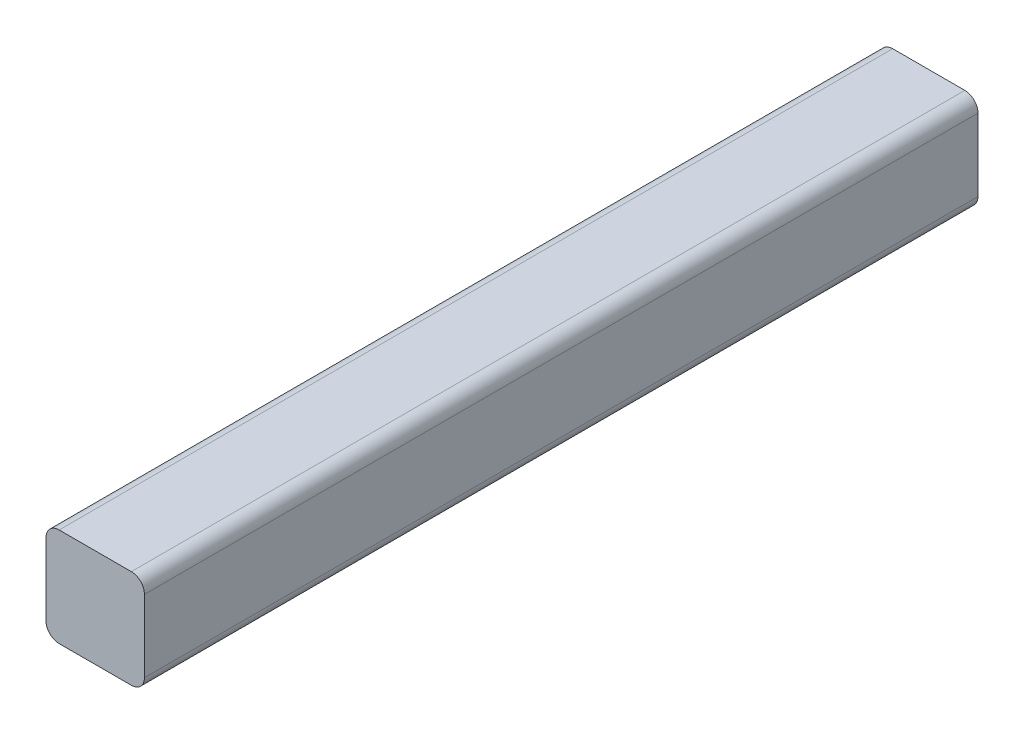
ISO-10303-21;
HEADER;
FILE_DESCRIPTION(('STEP AP214'),'2;1');
FILE_NAME('part.step','',(''),(''),'','','');
FILE_SCHEMA(('AUTOMOTIVE_DESIGN { 1 0 10303 214 1 1 1 1 }'));
ENDSEC;
DATA;
#1=APPLICATION_CONTEXT('core data for automotive mechanical design processes');
#2=APPLICATION_PROTOCOL_DEFINITION('international standard','automotive_design',2000,#1);
#3=PRODUCT_CONTEXT('',#1,'mechanical');
#4=PRODUCT('Part','Part','',(#3));
#5=PRODUCT_RELATED_PRODUCT_CATEGORY('part','',(#4));
#6=PRODUCT_DEFINITION_FORMATION('','',#4);
#7=PRODUCT_DEFINITION_CONTEXT('part definition',#1,'design');
#8=PRODUCT_DEFINITION('design','',#6,#7);
#9=PRODUCT_DEFINITION_SHAPE('','',#8);
#10=(LENGTH_UNIT() NAMED_UNIT(*) SI_UNIT(.MILLI.,.METRE.));
#11=(NAMED_UNIT(*) PLANE_ANGLE_UNIT() SI_UNIT($,.RADIAN.));
#12=(NAMED_UNIT(*) SI_UNIT($,.STERADIAN.) SOLID_ANGLE_UNIT());
#13=UNCERTAINTY_MEASURE_WITH_UNIT(LENGTH_MEASURE(1.E-05),#10,'distance_accuracy_value','');
#14=(GEOMETRIC_REPRESENTATION_CONTEXT(3) GLOBAL_UNCERTAINTY_ASSIGNED_CONTEXT((#13)) GLOBAL_UNIT_ASSIGNED_CONTEXT((#10,
#11,#12)) REPRESENTATION_CONTEXT('',''));
#15=CARTESIAN_POINT('',(0.,0.,0.));
#16=DIRECTION('',(0.,0.,1.));
#17=DIRECTION('',(1.,0.,0.));
#18=AXIS2_PLACEMENT_3D('',#15,#16,#17);
#19=CARTESIAN_POINT('',(-7.5,-7.5,127.));
#20=DIRECTION('',(1.,0.,0.));
#21=DIRECTION('',(0.,0.,-1.));
#22=AXIS2_PLACEMENT_3D('',#19,#20,#21);
#23=PLANE('',#22);
#24=DIRECTION('',(0.,-1.,0.));
#25=VECTOR('',#24,1.);
#26=CARTESIAN_POINT('',(-7.5,-7.5,0.));
#27=LINE('',#26,#25);
#28=CARTESIAN_POINT('',(-7.5,5.5,0.));
#29=VERTEX_POINT('',#28);
#30=CARTESIAN_POINT('',(-7.5,-5.5,0.));
#31=VERTEX_POINT('',#30);
#32=EDGE_CURVE('E125',#29,#31,#27,.T.);
#33=ORIENTED_EDGE('',*,*,#32,.T.);
#34=DIRECTION('',(0.,0.,-1.));
#35=VECTOR('',#34,1.);
#36=CARTESIAN_POINT('',(-7.5,-5.5,127.));
#37=LINE('',#36,#35);
#38=CARTESIAN_POINT('',(-7.5,-5.5,127.));
#39=VERTEX_POINT('',#38);
#40=EDGE_CURVE('E103',#31,#39,#37,.F.);
#41=ORIENTED_EDGE('',*,*,#40,.T.);
#42=DIRECTION('',(0.,-1.,0.));
#43=VECTOR('',#42,1.);
#44=CARTESIAN_POINT('',(-7.5,-7.5,127.));
#45=LINE('',#44,#43);
#46=CARTESIAN_POINT('',(-7.5,5.5,127.));
#47=VERTEX_POINT('',#46);
#48=EDGE_CURVE('E134',#47,#39,#45,.T.);
#49=ORIENTED_EDGE('',*,*,#48,.F.);
#50=DIRECTION('',(0.,0.,-1.));
#51=VECTOR('',#50,1.);
#52=CARTESIAN_POINT('',(-7.5,5.5,127.));
#53=LINE('',#52,#51);
#54=EDGE_CURVE('E108',#47,#29,#53,.T.);
#55=ORIENTED_EDGE('',*,*,#54,.T.);
#56=EDGE_LOOP('',(#33,#41,#49,#55));
#57=FACE_BOUND('',#56,.T.);
#58=ADVANCED_FACE('F33',(#57),#23,.F.);
#59=CARTESIAN_POINT('',(7.5,-7.5,127.));
#60=DIRECTION('',(0.,1.,0.));
#61=DIRECTION('',(-1.,0.,0.));
#62=AXIS2_PLACEMENT_3D('',#59,#60,#61);
#63=PLANE('',#62);
#64=DIRECTION('',(1.,0.,0.));
#65=VECTOR('',#64,1.);
#66=CARTESIAN_POINT('',(7.5,-7.5,127.));
#67=LINE('',#66,#65);
#68=CARTESIAN_POINT('',(-5.5,-7.5,127.));
#69=VERTEX_POINT('',#68);
#70=CARTESIAN_POINT('',(5.5,-7.5,127.));
#71=VERTEX_POINT('',#70);
#72=EDGE_CURVE('E118',#69,#71,#67,.T.);
#73=ORIENTED_EDGE('',*,*,#72,.F.);
#74=DIRECTION('',(0.,0.,-1.));
#75=VECTOR('',#74,1.);
#76=CARTESIAN_POINT('',(-5.5,-7.5,127.));
#77=LINE('',#76,#75);
#78=CARTESIAN_POINT('',(-5.5,-7.5,0.));
#79=VERTEX_POINT('',#78);
#80=EDGE_CURVE('E102',#69,#79,#77,.T.);
#81=ORIENTED_EDGE('',*,*,#80,.T.);
#82=DIRECTION('',(1.,0.,0.));
#83=VECTOR('',#82,1.);
#84=CARTESIAN_POINT('',(7.5,-7.5,0.));
#85=LINE('',#84,#83);
#86=CARTESIAN_POINT('',(5.5,-7.5,0.));
#87=VERTEX_POINT('',#86);
#88=EDGE_CURVE('E115',#79,#87,#85,.T.);
#89=ORIENTED_EDGE('',*,*,#88,.T.);
#90=DIRECTION('',(0.,0.,-1.));
#91=VECTOR('',#90,1.);
#92=CARTESIAN_POINT('',(5.5,-7.5,127.));
#93=LINE('',#92,#91);
#94=EDGE_CURVE('E120',#87,#71,#93,.F.);
#95=ORIENTED_EDGE('',*,*,#94,.T.);
#96=EDGE_LOOP('',(#73,#81,#89,#95));
#97=FACE_BOUND('',#96,.T.);
#98=ADVANCED_FACE('F114',(#97),#63,.F.);
#99=CARTESIAN_POINT('',(7.5,-7.5,127.));
#100=DIRECTION('',(-1.,0.,0.));
#101=DIRECTION('',(0.,-1.,0.));
#102=AXIS2_PLACEMENT_3D('',#99,#100,#101);
#103=PLANE('',#102);
#104=DIRECTION('',(0.,1.,0.));
#105=VECTOR('',#104,1.);
#106=CARTESIAN_POINT('',(7.5,-7.5,127.));
#107=LINE('',#106,#105);
#108=CARTESIAN_POINT('',(7.5,-5.5,127.));
#109=VERTEX_POINT('',#108);
#110=CARTESIAN_POINT('',(7.5,5.5,127.));
#111=VERTEX_POINT('',#110);
#112=EDGE_CURVE('E168',#109,#111,#107,.T.);
#113=ORIENTED_EDGE('',*,*,#112,.F.);
#114=DIRECTION('',(0.,0.,-1.));
#115=VECTOR('',#114,1.);
#116=CARTESIAN_POINT('',(7.5,-5.5,127.));
#117=LINE('',#116,#115);
#118=CARTESIAN_POINT('',(7.5,-5.5,0.));
#119=VERTEX_POINT('',#118);
#120=EDGE_CURVE('E153',#109,#119,#117,.T.);
#121=ORIENTED_EDGE('',*,*,#120,.T.);
#122=DIRECTION('',(0.,1.,0.));
#123=VECTOR('',#122,1.);
#124=CARTESIAN_POINT('',(7.5,-7.5,0.));
#125=LINE('',#124,#123);
#126=CARTESIAN_POINT('',(7.5,5.5,0.));
#127=VERTEX_POINT('',#126);
#128=EDGE_CURVE('E124',#119,#127,#125,.T.);
#129=ORIENTED_EDGE('',*,*,#128,.T.);
#130=DIRECTION('',(0.,0.,-1.));
#131=VECTOR('',#130,1.);
#132=CARTESIAN_POINT('',(7.5,5.5,127.));
#133=LINE('',#132,#131);
#134=EDGE_CURVE('E151',#127,#111,#133,.F.);
#135=ORIENTED_EDGE('',*,*,#134,.T.);
#136=EDGE_LOOP('',(#113,#121,#129,#135));
#137=FACE_BOUND('',#136,.T.);
#138=ADVANCED_FACE('F179',(#137),#103,.F.);
#139=CARTESIAN_POINT('',(7.5,7.5,127.));
#140=DIRECTION('',(0.,-1.,0.));
#141=DIRECTION('',(1.,0.,0.));
#142=AXIS2_PLACEMENT_3D('',#139,#140,#141);
#143=PLANE('',#142);
#144=DIRECTION('',(-1.,0.,0.));
#145=VECTOR('',#144,1.);
#146=CARTESIAN_POINT('',(7.5,7.5,0.));
#147=LINE('',#146,#145);
#148=CARTESIAN_POINT('',(5.5,7.5,0.));
#149=VERTEX_POINT('',#148);
#150=CARTESIAN_POINT('',(-5.5,7.5,0.));
#151=VERTEX_POINT('',#150);
#152=EDGE_CURVE('E128',#149,#151,#147,.T.);
#153=ORIENTED_EDGE('',*,*,#152,.T.);
#154=DIRECTION('',(0.,0.,-1.));
#155=VECTOR('',#154,1.);
#156=CARTESIAN_POINT('',(-5.5,7.5,127.));
#157=LINE('',#156,#155);
#158=CARTESIAN_POINT('',(-5.5,7.5,127.));
#159=VERTEX_POINT('',#158);
#160=EDGE_CURVE('E11',#151,#159,#157,.F.);
#161=ORIENTED_EDGE('',*,*,#160,.T.);
#162=DIRECTION('',(-1.,0.,0.));
#163=VECTOR('',#162,1.);
#164=CARTESIAN_POINT('',(7.5,7.5,127.));
#165=LINE('',#164,#163);
#166=CARTESIAN_POINT('',(5.5,7.5,127.));
#167=VERTEX_POINT('',#166);
#168=EDGE_CURVE('E135',#167,#159,#165,.T.);
#169=ORIENTED_EDGE('',*,*,#168,.F.);
#170=DIRECTION('',(0.,0.,-1.));
#171=VECTOR('',#170,1.);
#172=CARTESIAN_POINT('',(5.5,7.5,127.));
#173=LINE('',#172,#171);
#174=EDGE_CURVE('E41',#167,#149,#173,.T.);
#175=ORIENTED_EDGE('',*,*,#174,.T.);
#176=EDGE_LOOP('',(#153,#161,#169,#175));
#177=FACE_BOUND('',#176,.T.);
#178=ADVANCED_FACE('F158',(#177),#143,.F.);
#179=CARTESIAN_POINT('',(0.,0.,127.));
#180=DIRECTION('',(0.,0.,1.));
#181=DIRECTION('',(1.,0.,0.));
#182=AXIS2_PLACEMENT_3D('',#179,#180,#181);
#183=PLANE('',#182);
#184=ORIENTED_EDGE('',*,*,#48,.T.);
#185=CARTESIAN_POINT('',(-5.5,-5.5,127.));
#186=DIRECTION('',(0.,0.,1.));
#187=DIRECTION('',(1.,0.,0.));
#188=AXIS2_PLACEMENT_3D('',#185,#186,#187);
#189=CIRCLE('',#188,2.);
#190=EDGE_CURVE('E149',#39,#69,#189,.T.);
#191=ORIENTED_EDGE('',*,*,#190,.T.);
#192=ORIENTED_EDGE('',*,*,#72,.T.);
#193=CARTESIAN_POINT('',(5.5,-5.5,127.));
#194=DIRECTION('',(0.,0.,1.));
#195=DIRECTION('',(1.,0.,0.));
#196=AXIS2_PLACEMENT_3D('',#193,#194,#195);
#197=CIRCLE('',#196,2.);
#198=EDGE_CURVE('E147',#71,#109,#197,.T.);
#199=ORIENTED_EDGE('',*,*,#198,.T.);
#200=ORIENTED_EDGE('',*,*,#112,.T.);
#201=CARTESIAN_POINT('',(5.5,5.5,127.));
#202=DIRECTION('',(0.,0.,1.));
#203=DIRECTION('',(1.,0.,0.));
#204=AXIS2_PLACEMENT_3D('',#201,#202,#203);
#205=CIRCLE('',#204,2.);
#206=EDGE_CURVE('E53',#111,#167,#205,.T.);
#207=ORIENTED_EDGE('',*,*,#206,.T.);
#208=ORIENTED_EDGE('',*,*,#168,.T.);
#209=CARTESIAN_POINT('',(-5.5,5.5,127.));
#210=DIRECTION('',(0.,0.,1.));
#211=DIRECTION('',(1.,0.,0.));
#212=AXIS2_PLACEMENT_3D('',#209,#210,#211);
#213=CIRCLE('',#212,2.);
#214=EDGE_CURVE('E145',#159,#47,#213,.T.);
#215=ORIENTED_EDGE('',*,*,#214,.T.);
#216=EDGE_LOOP('',(#184,#191,#192,#199,#200,#207,#208,#215));
#217=FACE_BOUND('',#216,.T.);
#218=ADVANCED_FACE('F171',(#217),#183,.T.);
#219=CARTESIAN_POINT('',(0.,0.,0.));
#220=DIRECTION('',(0.,0.,1.));
#221=DIRECTION('',(1.,0.,0.));
#222=AXIS2_PLACEMENT_3D('',#219,#220,#221);
#223=PLANE('',#222);
#224=ORIENTED_EDGE('',*,*,#88,.F.);
#225=CARTESIAN_POINT('',(-5.5,-5.5,0.));
#226=DIRECTION('',(0.,0.,1.));
#227=DIRECTION('',(1.,0.,0.));
#228=AXIS2_PLACEMENT_3D('',#225,#226,#227);
#229=CIRCLE('',#228,2.);
#230=EDGE_CURVE('E98',#79,#31,#229,.F.);
#231=ORIENTED_EDGE('',*,*,#230,.T.);
#232=ORIENTED_EDGE('',*,*,#32,.F.);
#233=CARTESIAN_POINT('',(-5.5,5.5,0.));
#234=DIRECTION('',(0.,0.,1.));
#235=DIRECTION('',(1.,0.,0.));
#236=AXIS2_PLACEMENT_3D('',#233,#234,#235);
#237=CIRCLE('',#236,2.);
#238=EDGE_CURVE('E138',#29,#151,#237,.F.);
#239=ORIENTED_EDGE('',*,*,#238,.T.);
#240=ORIENTED_EDGE('',*,*,#152,.F.);
#241=CARTESIAN_POINT('',(5.5,5.5,0.));
#242=DIRECTION('',(0.,0.,1.));
#243=DIRECTION('',(1.,0.,0.));
#244=AXIS2_PLACEMENT_3D('',#241,#242,#243);
#245=CIRCLE('',#244,2.);
#246=EDGE_CURVE('E119',#149,#127,#245,.F.);
#247=ORIENTED_EDGE('',*,*,#246,.T.);
#248=ORIENTED_EDGE('',*,*,#128,.F.);
#249=CARTESIAN_POINT('',(5.5,-5.5,0.));
#250=DIRECTION('',(0.,0.,1.));
#251=DIRECTION('',(1.,0.,0.));
#252=AXIS2_PLACEMENT_3D('',#249,#250,#251);
#253=CIRCLE('',#252,2.);
#254=EDGE_CURVE('E109',#119,#87,#253,.F.);
#255=ORIENTED_EDGE('',*,*,#254,.T.);
#256=EDGE_LOOP('',(#224,#231,#232,#239,#240,#247,#248,#255));
#257=FACE_BOUND('',#256,.T.);
#258=ADVANCED_FACE('F122',(#257),#223,.F.);
#259=CARTESIAN_POINT('',(-5.5,-5.5,127.));
#260=DIRECTION('',(0.,0.,-1.));
#261=DIRECTION('',(-1.,0.,0.));
#262=AXIS2_PLACEMENT_3D('',#259,#260,#261);
#263=CYLINDRICAL_SURFACE('',#262,2.);
#264=ORIENTED_EDGE('',*,*,#190,.F.);
#265=ORIENTED_EDGE('',*,*,#40,.F.);
#266=ORIENTED_EDGE('',*,*,#230,.F.);
#267=ORIENTED_EDGE('',*,*,#80,.F.);
#268=EDGE_LOOP('',(#264,#265,#266,#267));
#269=FACE_BOUND('',#268,.T.);
#270=ADVANCED_FACE('F101',(#269),#263,.T.);
#271=CARTESIAN_POINT('',(5.5,-5.5,127.));
#272=DIRECTION('',(0.,0.,-1.));
#273=DIRECTION('',(-1.,0.,0.));
#274=AXIS2_PLACEMENT_3D('',#271,#272,#273);
#275=CYLINDRICAL_SURFACE('',#274,2.);
#276=ORIENTED_EDGE('',*,*,#198,.F.);
#277=ORIENTED_EDGE('',*,*,#94,.F.);
#278=ORIENTED_EDGE('',*,*,#254,.F.);
#279=ORIENTED_EDGE('',*,*,#120,.F.);
#280=EDGE_LOOP('',(#276,#277,#278,#279));
#281=FACE_BOUND('',#280,.T.);
#282=ADVANCED_FACE('F191',(#281),#275,.T.);
#283=CARTESIAN_POINT('',(-5.5,5.5,127.));
#284=DIRECTION('',(0.,0.,-1.));
#285=DIRECTION('',(-1.,0.,0.));
#286=AXIS2_PLACEMENT_3D('',#283,#284,#285);
#287=CYLINDRICAL_SURFACE('',#286,2.);
#288=ORIENTED_EDGE('',*,*,#214,.F.);
#289=ORIENTED_EDGE('',*,*,#160,.F.);
#290=ORIENTED_EDGE('',*,*,#238,.F.);
#291=ORIENTED_EDGE('',*,*,#54,.F.);
#292=EDGE_LOOP('',(#288,#289,#290,#291));
#293=FACE_BOUND('',#292,.T.);
#294=ADVANCED_FACE('F163',(#293),#287,.T.);
#295=CARTESIAN_POINT('',(5.5,5.5,127.));
#296=DIRECTION('',(0.,0.,-1.));
#297=DIRECTION('',(-1.,0.,0.));
#298=AXIS2_PLACEMENT_3D('',#295,#296,#297);
#299=CYLINDRICAL_SURFACE('',#298,2.);
#300=ORIENTED_EDGE('',*,*,#206,.F.);
#301=ORIENTED_EDGE('',*,*,#134,.F.);
#302=ORIENTED_EDGE('',*,*,#246,.F.);
#303=ORIENTED_EDGE('',*,*,#174,.F.);
#304=EDGE_LOOP('',(#300,#301,#302,#303));
#305=FACE_BOUND('',#304,.T.);
#306=ADVANCED_FACE('F35',(#305),#299,.T.);
#307=CLOSED_SHELL('',(#58,#98,#138,#178,#218,#258,#270,#282,#294,#306));
#308=MANIFOLD_SOLID_BREP('B2',#307);
#309=ADVANCED_BREP_SHAPE_REPRESENTATION('',(#18,#308),#14);
#310=SHAPE_DEFINITION_REPRESENTATION(#9,#309);
ENDSEC;
END-ISO-10303-21;
